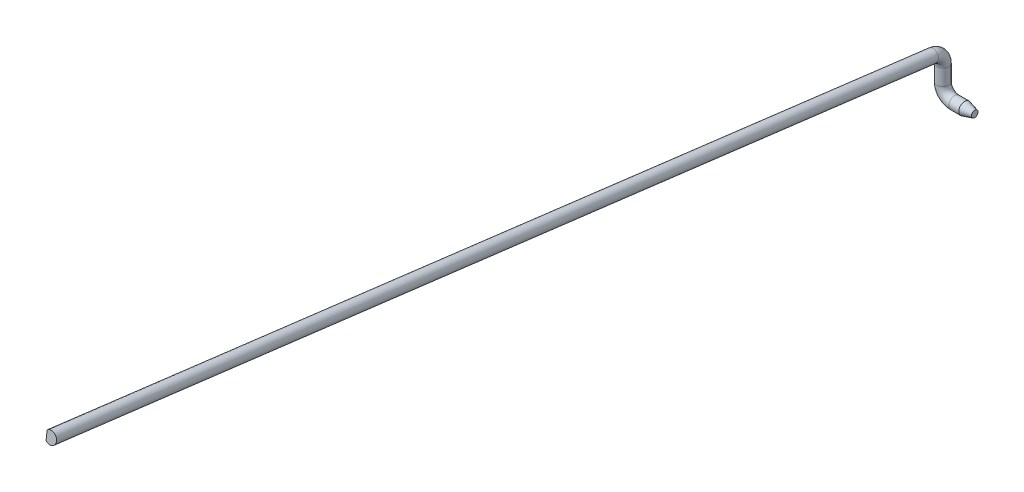
ISO-10303-21;
HEADER;
FILE_DESCRIPTION(('STEP AP214'),'2;1');
FILE_NAME('part.step','',(''),(''),'','','');
FILE_SCHEMA(('AUTOMOTIVE_DESIGN { 1 0 10303 214 1 1 1 1 }'));
ENDSEC;
DATA;
#1=APPLICATION_CONTEXT('core data for automotive mechanical design processes');
#2=APPLICATION_PROTOCOL_DEFINITION('international standard','automotive_design',2000,#1);
#3=PRODUCT_CONTEXT('',#1,'mechanical');
#4=PRODUCT('Part','Part','',(#3));
#5=PRODUCT_RELATED_PRODUCT_CATEGORY('part','',(#4));
#6=PRODUCT_DEFINITION_FORMATION('','',#4);
#7=PRODUCT_DEFINITION_CONTEXT('part definition',#1,'design');
#8=PRODUCT_DEFINITION('design','',#6,#7);
#9=PRODUCT_DEFINITION_SHAPE('','',#8);
#10=(LENGTH_UNIT() NAMED_UNIT(*) SI_UNIT(.MILLI.,.METRE.));
#11=(NAMED_UNIT(*) PLANE_ANGLE_UNIT() SI_UNIT($,.RADIAN.));
#12=(NAMED_UNIT(*) SI_UNIT($,.STERADIAN.) SOLID_ANGLE_UNIT());
#13=UNCERTAINTY_MEASURE_WITH_UNIT(LENGTH_MEASURE(1.E-05),#10,'distance_accuracy_value','');
#14=(GEOMETRIC_REPRESENTATION_CONTEXT(3) GLOBAL_UNCERTAINTY_ASSIGNED_CONTEXT((#13)) GLOBAL_UNIT_ASSIGNED_CONTEXT((#10,
#11,#12)) REPRESENTATION_CONTEXT('',''));
#15=CARTESIAN_POINT('',(0.,0.,0.));
#16=DIRECTION('',(0.,0.,1.));
#17=DIRECTION('',(1.,0.,0.));
#18=AXIS2_PLACEMENT_3D('',#15,#16,#17);
#19=CARTESIAN_POINT('',(0.,4.97687314642375,2.6282120629967));
#20=DIRECTION('',(0.,0.123929312334433,0.992291048807916));
#21=DIRECTION('',(0.,-0.992291048807917,0.123929312334433));
#22=AXIS2_PLACEMENT_3D('',#19,#20,#21);
#23=CYLINDRICAL_SURFACE('',#22,1.5);
#24=DIRECTION('',(0.,0.123929312334433,0.992291048807916));
#25=VECTOR('',#24,1.);
#26=CARTESIAN_POINT('',(-1.,6.08628826572328,2.4896548796044));
#27=LINE('',#26,#25);
#28=CARTESIAN_POINT('',(-1.,33.7290616809717,223.822898060647));
#29=VERTEX_POINT('',#28);
#30=CARTESIAN_POINT('',(-1.,31.8701219959552,208.938532328528));
#31=VERTEX_POINT('',#30);
#32=EDGE_CURVE('E59',#29,#31,#27,.F.);
#33=ORIENTED_EDGE('',*,*,#32,.F.);
#34=CARTESIAN_POINT('',(0.,32.6196465616722,223.96145524404));
#35=DIRECTION('',(0.,0.123929312334433,0.992291048807916));
#36=DIRECTION('',(0.,-0.992291048807916,0.123929312334433));
#37=AXIS2_PLACEMENT_3D('',#34,#35,#36);
#38=CIRCLE('',#37,1.5);
#39=CARTESIAN_POINT('',(-1.,31.5102314423726,224.100012427432));
#40=VERTEX_POINT('',#39);
#41=EDGE_CURVE('E64',#40,#29,#38,.T.);
#42=ORIENTED_EDGE('',*,*,#41,.F.);
#43=DIRECTION('',(0.,0.123929312334433,0.992291048807916));
#44=VECTOR('',#43,1.);
#45=CARTESIAN_POINT('',(-1.,3.86745802712422,2.766769246389));
#46=LINE('',#45,#44);
#47=CARTESIAN_POINT('',(-1.,29.6512917573561,209.215646695313));
#48=VERTEX_POINT('',#47);
#49=EDGE_CURVE('E44',#48,#40,#46,.T.);
#50=ORIENTED_EDGE('',*,*,#49,.F.);
#51=CARTESIAN_POINT('',(0.,30.7607068766557,209.077089511921));
#52=DIRECTION('',(0.,-0.123929312334431,-0.992291048807917));
#53=DIRECTION('',(0.,0.992291048807917,-0.123929312334431));
#54=AXIS2_PLACEMENT_3D('',#51,#52,#53);
#55=CIRCLE('',#54,1.5);
#56=EDGE_CURVE('E11',#31,#48,#55,.F.);
#57=ORIENTED_EDGE('',*,*,#56,.F.);
#58=EDGE_LOOP('',(#33,#42,#50,#57));
#59=FACE_BOUND('',#58,.T.);
#60=CARTESIAN_POINT('',(0.,4.97687314642375,2.6282120629967));
#61=DIRECTION('',(0.,0.123929312334433,0.992291048807916));
#62=DIRECTION('',(0.,-0.992291048807916,0.123929312334433));
#63=AXIS2_PLACEMENT_3D('',#60,#61,#62);
#64=CIRCLE('',#63,1.5);
#65=CARTESIAN_POINT('',(0.,6.46530971963562,2.44231809449505));
#66=VERTEX_POINT('',#65);
#67=EDGE_CURVE('E77',#66,#66,#64,.T.);
#68=ORIENTED_EDGE('',*,*,#67,.T.);
#69=EDGE_LOOP('',(#68));
#70=FACE_BOUND('',#69,.T.);
#71=ADVANCED_FACE('F30',(#59,#70),#23,.T.);
#72=CARTESIAN_POINT('',(0.,2.,3.));
#73=DIRECTION('',(1.,0.,0.));
#74=DIRECTION('',(0.,0.,-1.));
#75=AXIS2_PLACEMENT_3D('',#72,#73,#74);
#76=TOROIDAL_SURFACE('',#75,3.,1.5);
#77=CARTESIAN_POINT('',(0.,2.,0.));
#78=DIRECTION('',(0.,1.,0.));
#79=DIRECTION('',(0.,0.,1.));
#80=AXIS2_PLACEMENT_3D('',#77,#78,#79);
#81=CIRCLE('',#80,1.5);
#82=CARTESIAN_POINT('',(0.,2.,-1.5));
#83=VERTEX_POINT('',#82);
#84=EDGE_CURVE('E74',#83,#83,#81,.T.);
#85=CARTESIAN_POINT('',(0.,2.,3.));
#86=DIRECTION('',(1.,0.,0.));
#87=DIRECTION('',(0.,0.,-1.));
#88=AXIS2_PLACEMENT_3D('',#85,#86,#87);
#89=CIRCLE('',#88,4.5);
#90=EDGE_CURVE('',#83,#66,#89,.T.);
#91=ORIENTED_EDGE('',*,*,#84,.T.);
#92=ORIENTED_EDGE('',*,*,#67,.F.);
#93=ORIENTED_EDGE('',*,*,#90,.T.);
#94=ORIENTED_EDGE('',*,*,#90,.F.);
#95=EDGE_LOOP('',(#91,#93,#92,#94));
#96=FACE_BOUND('',#95,.T.);
#97=ADVANCED_FACE('F107',(#96),#76,.T.);
#98=CARTESIAN_POINT('',(0.,2.,0.));
#99=DIRECTION('',(0.,-1.,0.));
#100=DIRECTION('',(0.,0.,-1.));
#101=AXIS2_PLACEMENT_3D('',#98,#99,#100);
#102=CYLINDRICAL_SURFACE('',#101,1.5);
#103=ORIENTED_EDGE('',*,*,#84,.F.);
#104=EDGE_LOOP('',(#103));
#105=FACE_BOUND('',#104,.T.);
#106=CARTESIAN_POINT('',(0.,-2.,0.));
#107=DIRECTION('',(0.,-1.,0.));
#108=DIRECTION('',(0.,0.,-1.));
#109=AXIS2_PLACEMENT_3D('',#106,#107,#108);
#110=CIRCLE('',#109,1.5);
#111=CARTESIAN_POINT('',(-1.5,-2.,0.));
#112=VERTEX_POINT('',#111);
#113=EDGE_CURVE('E66',#112,#112,#110,.T.);
#114=ORIENTED_EDGE('',*,*,#113,.F.);
#115=EDGE_LOOP('',(#114));
#116=FACE_BOUND('',#115,.T.);
#117=ADVANCED_FACE('F111',(#105,#116),#102,.T.);
#118=CARTESIAN_POINT('',(0.,32.6196465616722,223.96145524404));
#119=DIRECTION('',(0.,0.123929312334433,0.992291048807916));
#120=DIRECTION('',(0.,-0.992291048807916,0.123929312334433));
#121=AXIS2_PLACEMENT_3D('',#118,#119,#120);
#122=PLANE('',#121);
#123=DIRECTION('',(0.,0.992291048807917,-0.123929312334433));
#124=VECTOR('',#123,1.);
#125=CARTESIAN_POINT('',(-1.,32.6196465616722,223.96145524404));
#126=LINE('',#125,#124);
#127=EDGE_CURVE('E37',#40,#29,#126,.T.);
#128=ORIENTED_EDGE('',*,*,#127,.F.);
#129=ORIENTED_EDGE('',*,*,#41,.T.);
#130=EDGE_LOOP('',(#128,#129));
#131=FACE_BOUND('',#130,.T.);
#132=ADVANCED_FACE('F116',(#131),#122,.T.);
#133=CARTESIAN_POINT('',(3.,-5.,0.));
#134=DIRECTION('',(1.,0.,0.));
#135=DIRECTION('',(0.,1.,0.));
#136=AXIS2_PLACEMENT_3D('',#133,#134,#135);
#137=CYLINDRICAL_SURFACE('',#136,1.5);
#138=CARTESIAN_POINT('',(5.5,-5.,0.));
#139=DIRECTION('',(1.,0.,0.));
#140=DIRECTION('',(0.,0.,-1.));
#141=AXIS2_PLACEMENT_3D('',#138,#139,#140);
#142=CIRCLE('',#141,1.5);
#143=CARTESIAN_POINT('',(5.5,-5.,-1.5));
#144=VERTEX_POINT('',#143);
#145=EDGE_CURVE('E84',#144,#144,#142,.F.);
#146=ORIENTED_EDGE('',*,*,#145,.T.);
#147=EDGE_LOOP('',(#146));
#148=FACE_BOUND('',#147,.T.);
#149=CARTESIAN_POINT('',(3.,-5.,0.));
#150=DIRECTION('',(1.,0.,0.));
#151=DIRECTION('',(0.,0.,-1.));
#152=AXIS2_PLACEMENT_3D('',#149,#150,#151);
#153=CIRCLE('',#152,1.5);
#154=CARTESIAN_POINT('',(3.,-6.5,0.));
#155=VERTEX_POINT('',#154);
#156=EDGE_CURVE('E71',#155,#155,#153,.T.);
#157=ORIENTED_EDGE('',*,*,#156,.T.);
#158=EDGE_LOOP('',(#157));
#159=FACE_BOUND('',#158,.T.);
#160=ADVANCED_FACE('F88',(#148,#159),#137,.T.);
#161=CARTESIAN_POINT('',(3.,-2.,0.));
#162=DIRECTION('',(0.,0.,1.));
#163=DIRECTION('',(1.,0.,0.));
#164=AXIS2_PLACEMENT_3D('',#161,#162,#163);
#165=TOROIDAL_SURFACE('',#164,3.,1.5);
#166=CARTESIAN_POINT('',(3.,-2.,0.));
#167=DIRECTION('',(0.,0.,1.));
#168=DIRECTION('',(1.,0.,0.));
#169=AXIS2_PLACEMENT_3D('',#166,#167,#168);
#170=CIRCLE('',#169,4.5);
#171=EDGE_CURVE('',#112,#155,#170,.T.);
#172=ORIENTED_EDGE('',*,*,#113,.T.);
#173=ORIENTED_EDGE('',*,*,#156,.F.);
#174=ORIENTED_EDGE('',*,*,#171,.T.);
#175=ORIENTED_EDGE('',*,*,#171,.F.);
#176=EDGE_LOOP('',(#172,#174,#173,#175));
#177=FACE_BOUND('',#176,.T.);
#178=ADVANCED_FACE('F99',(#177),#165,.T.);
#179=CARTESIAN_POINT('',(8.,-5.,0.));
#180=DIRECTION('',(1.,0.,0.));
#181=DIRECTION('',(0.,0.,-1.));
#182=AXIS2_PLACEMENT_3D('',#179,#180,#181);
#183=PLANE('',#182);
#184=CARTESIAN_POINT('',(8.,-5.,0.));
#185=DIRECTION('',(1.,0.,0.));
#186=DIRECTION('',(0.,1.,0.));
#187=AXIS2_PLACEMENT_3D('',#184,#185,#186);
#188=CIRCLE('',#187,0.830127018922204);
#189=CARTESIAN_POINT('',(8.,-4.16987298107779,0.));
#190=VERTEX_POINT('',#189);
#191=EDGE_CURVE('E81',#190,#190,#188,.T.);
#192=ORIENTED_EDGE('',*,*,#191,.T.);
#193=EDGE_LOOP('',(#192));
#194=FACE_BOUND('',#193,.T.);
#195=ADVANCED_FACE('F94',(#194),#183,.T.);
#196=CARTESIAN_POINT('',(8.,-5.,0.));
#197=DIRECTION('',(-1.,0.,0.));
#198=DIRECTION('',(0.,0.,1.));
#199=AXIS2_PLACEMENT_3D('',#196,#197,#198);
#200=CONICAL_SURFACE('',#199,0.830127018922204,0.261799387799146);
#201=ORIENTED_EDGE('',*,*,#145,.F.);
#202=EDGE_LOOP('',(#201));
#203=FACE_BOUND('',#202,.T.);
#204=ORIENTED_EDGE('',*,*,#191,.F.);
#205=EDGE_LOOP('',(#204));
#206=FACE_BOUND('',#205,.T.);
#207=ADVANCED_FACE('F91',(#203,#206),#200,.T.);
#208=CARTESIAN_POINT('',(-1.5,32.7452889742715,208.829230887252));
#209=DIRECTION('',(0.,-0.123929312334431,-0.992291048807917));
#210=DIRECTION('',(0.,0.992291048807917,-0.123929312334431));
#211=AXIS2_PLACEMENT_3D('',#208,#209,#210);
#212=PLANE('',#211);
#213=DIRECTION('',(0.,0.992291048807917,-0.123929312334431));
#214=VECTOR('',#213,1.);
#215=CARTESIAN_POINT('',(-1.,32.7452889742715,208.829230887252));
#216=LINE('',#215,#214);
#217=EDGE_CURVE('E56',#48,#31,#216,.T.);
#218=ORIENTED_EDGE('',*,*,#217,.T.);
#219=ORIENTED_EDGE('',*,*,#56,.T.);
#220=EDGE_LOOP('',(#218,#219));
#221=FACE_BOUND('',#220,.T.);
#222=ADVANCED_FACE('F55',(#221),#212,.F.);
#223=CARTESIAN_POINT('',(-1.,28.7761247790398,209.32494813659));
#224=DIRECTION('',(1.,0.,0.));
#225=DIRECTION('',(0.,0.,-1.));
#226=AXIS2_PLACEMENT_3D('',#223,#224,#225);
#227=PLANE('',#226);
#228=ORIENTED_EDGE('',*,*,#32,.T.);
#229=ORIENTED_EDGE('',*,*,#217,.F.);
#230=ORIENTED_EDGE('',*,*,#49,.T.);
#231=ORIENTED_EDGE('',*,*,#127,.T.);
#232=EDGE_LOOP('',(#228,#229,#230,#231));
#233=FACE_BOUND('',#232,.T.);
#234=ADVANCED_FACE('F58',(#233),#227,.F.);
#235=CLOSED_SHELL('',(#71,#97,#117,#132,#160,#178,#195,#207,#222,#234));
#236=MANIFOLD_SOLID_BREP('B2',#235);
#237=ADVANCED_BREP_SHAPE_REPRESENTATION('',(#18,#236),#14);
#238=SHAPE_DEFINITION_REPRESENTATION(#9,#237);
ENDSEC;
END-ISO-10303-21;
